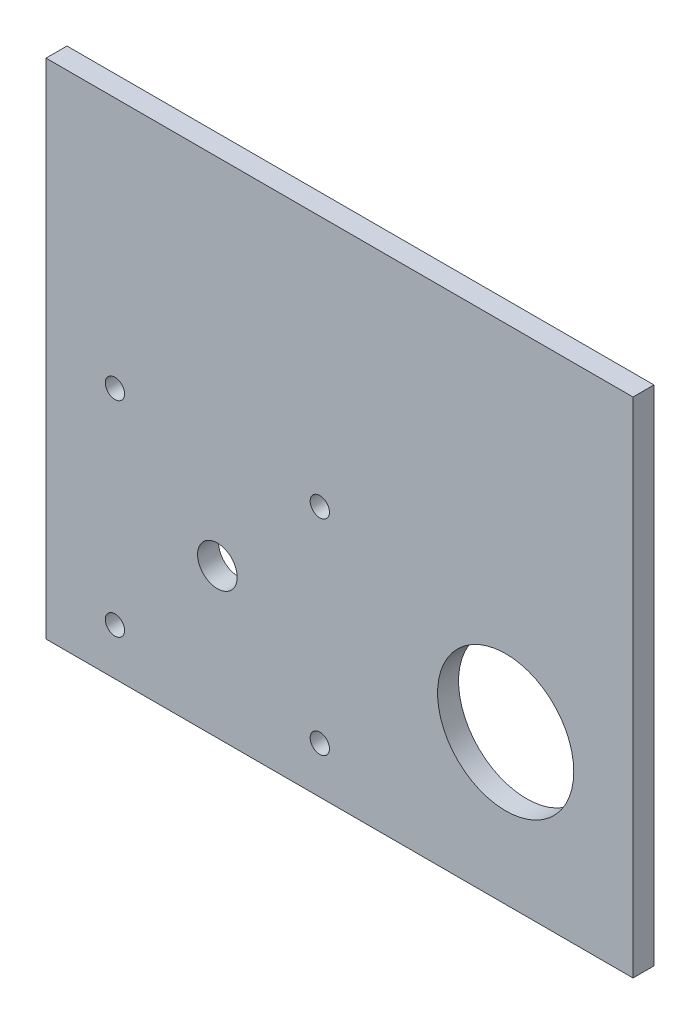
ISO-10303-21;
HEADER;
FILE_DESCRIPTION(('STEP AP214'),'2;1');
FILE_NAME('part.step','',(''),(''),'','','');
FILE_SCHEMA(('AUTOMOTIVE_DESIGN { 1 0 10303 214 1 1 1 1 }'));
ENDSEC;
DATA;
#1=APPLICATION_CONTEXT('core data for automotive mechanical design processes');
#2=APPLICATION_PROTOCOL_DEFINITION('international standard','automotive_design',2000,#1);
#3=PRODUCT_CONTEXT('',#1,'mechanical');
#4=PRODUCT('Part','Part','',(#3));
#5=PRODUCT_RELATED_PRODUCT_CATEGORY('part','',(#4));
#6=PRODUCT_DEFINITION_FORMATION('','',#4);
#7=PRODUCT_DEFINITION_CONTEXT('part definition',#1,'design');
#8=PRODUCT_DEFINITION('design','',#6,#7);
#9=PRODUCT_DEFINITION_SHAPE('','',#8);
#10=(LENGTH_UNIT() NAMED_UNIT(*) SI_UNIT(.MILLI.,.METRE.));
#11=(NAMED_UNIT(*) PLANE_ANGLE_UNIT() SI_UNIT($,.RADIAN.));
#12=(NAMED_UNIT(*) SI_UNIT($,.STERADIAN.) SOLID_ANGLE_UNIT());
#13=UNCERTAINTY_MEASURE_WITH_UNIT(LENGTH_MEASURE(1.E-05),#10,'distance_accuracy_value','');
#14=(GEOMETRIC_REPRESENTATION_CONTEXT(3) GLOBAL_UNCERTAINTY_ASSIGNED_CONTEXT((#13)) GLOBAL_UNIT_ASSIGNED_CONTEXT((#10,
#11,#12)) REPRESENTATION_CONTEXT('',''));
#15=CARTESIAN_POINT('',(0.,0.,0.));
#16=DIRECTION('',(0.,0.,1.));
#17=DIRECTION('',(1.,0.,0.));
#18=AXIS2_PLACEMENT_3D('',#15,#16,#17);
#19=CARTESIAN_POINT('',(0.,0.,3.175));
#20=DIRECTION('',(0.,0.,-1.));
#21=DIRECTION('',(-1.,0.,0.));
#22=AXIS2_PLACEMENT_3D('',#19,#20,#21);
#23=PLANE('',#22);
#24=CARTESIAN_POINT('',(25.95025,22.585,3.175));
#25=DIRECTION('',(0.,0.,1.));
#26=DIRECTION('',(1.,0.,0.));
#27=AXIS2_PLACEMENT_3D('',#24,#25,#26);
#28=CIRCLE('',#27,3.);
#29=CARTESIAN_POINT('',(28.95025,22.585,3.175));
#30=VERTEX_POINT('',#29);
#31=EDGE_CURVE('E132',#30,#30,#28,.T.);
#32=ORIENTED_EDGE('',*,*,#31,.F.);
#33=EDGE_LOOP('',(#32));
#34=FACE_BOUND('',#33,.T.);
#35=CARTESIAN_POINT('',(41.46525,7.07,3.175));
#36=DIRECTION('',(0.,0.,1.));
#37=DIRECTION('',(1.,0.,0.));
#38=AXIS2_PLACEMENT_3D('',#35,#36,#37);
#39=CIRCLE('',#38,1.4605);
#40=CARTESIAN_POINT('',(42.92575,7.07,3.175));
#41=VERTEX_POINT('',#40);
#42=EDGE_CURVE('E120',#41,#41,#39,.T.);
#43=ORIENTED_EDGE('',*,*,#42,.F.);
#44=EDGE_LOOP('',(#43));
#45=FACE_BOUND('',#44,.T.);
#46=CARTESIAN_POINT('',(10.43525,38.1,3.175));
#47=DIRECTION('',(0.,0.,1.));
#48=DIRECTION('',(1.,0.,0.));
#49=AXIS2_PLACEMENT_3D('',#46,#47,#48);
#50=CIRCLE('',#49,1.4605);
#51=CARTESIAN_POINT('',(11.89575,38.1,3.175));
#52=VERTEX_POINT('',#51);
#53=EDGE_CURVE('E99',#52,#52,#50,.T.);
#54=ORIENTED_EDGE('',*,*,#53,.F.);
#55=EDGE_LOOP('',(#54));
#56=FACE_BOUND('',#55,.T.);
#57=DIRECTION('',(0.,-1.,0.));
#58=VECTOR('',#57,1.);
#59=CARTESIAN_POINT('',(0.,0.,3.175));
#60=LINE('',#59,#58);
#61=CARTESIAN_POINT('',(0.,76.2,3.175));
#62=VERTEX_POINT('',#61);
#63=CARTESIAN_POINT('',(0.,0.,3.175));
#64=VERTEX_POINT('',#63);
#65=EDGE_CURVE('E84',#62,#64,#60,.T.);
#66=ORIENTED_EDGE('',*,*,#65,.T.);
#67=DIRECTION('',(1.,0.,0.));
#68=VECTOR('',#67,1.);
#69=CARTESIAN_POINT('',(0.,0.,3.175));
#70=LINE('',#69,#68);
#71=CARTESIAN_POINT('',(88.9,0.,3.175));
#72=VERTEX_POINT('',#71);
#73=EDGE_CURVE('E79',#64,#72,#70,.T.);
#74=ORIENTED_EDGE('',*,*,#73,.T.);
#75=DIRECTION('',(0.,1.,0.));
#76=VECTOR('',#75,1.);
#77=CARTESIAN_POINT('',(88.9,0.,3.175));
#78=LINE('',#77,#76);
#79=CARTESIAN_POINT('',(88.9,76.2,3.175));
#80=VERTEX_POINT('',#79);
#81=EDGE_CURVE('E82',#72,#80,#78,.T.);
#82=ORIENTED_EDGE('',*,*,#81,.T.);
#83=DIRECTION('',(-1.,0.,0.));
#84=VECTOR('',#83,1.);
#85=CARTESIAN_POINT('',(0.,76.2,3.175));
#86=LINE('',#85,#84);
#87=EDGE_CURVE('E49',#80,#62,#86,.T.);
#88=ORIENTED_EDGE('',*,*,#87,.T.);
#89=EDGE_LOOP('',(#66,#74,#82,#88));
#90=FACE_BOUND('',#89,.T.);
#91=CARTESIAN_POINT('',(41.46525,38.1,3.175));
#92=DIRECTION('',(0.,0.,1.));
#93=DIRECTION('',(1.,0.,0.));
#94=AXIS2_PLACEMENT_3D('',#91,#92,#93);
#95=CIRCLE('',#94,1.4605);
#96=CARTESIAN_POINT('',(42.92575,38.1,3.175));
#97=VERTEX_POINT('',#96);
#98=EDGE_CURVE('E114',#97,#97,#95,.T.);
#99=ORIENTED_EDGE('',*,*,#98,.F.);
#100=EDGE_LOOP('',(#99));
#101=FACE_BOUND('',#100,.T.);
#102=CARTESIAN_POINT('',(10.43525,7.07,3.175));
#103=DIRECTION('',(0.,0.,1.));
#104=DIRECTION('',(1.,0.,0.));
#105=AXIS2_PLACEMENT_3D('',#102,#103,#104);
#106=CIRCLE('',#105,1.4605);
#107=CARTESIAN_POINT('',(11.89575,7.07,3.175));
#108=VERTEX_POINT('',#107);
#109=EDGE_CURVE('E126',#108,#108,#106,.T.);
#110=ORIENTED_EDGE('',*,*,#109,.F.);
#111=EDGE_LOOP('',(#110));
#112=FACE_BOUND('',#111,.T.);
#113=CARTESIAN_POINT('',(69.61285,22.585,3.175));
#114=DIRECTION('',(0.,0.,1.));
#115=DIRECTION('',(1.,0.,0.));
#116=AXIS2_PLACEMENT_3D('',#113,#114,#115);
#117=CIRCLE('',#116,10.3124);
#118=CARTESIAN_POINT('',(79.92525,22.585,3.175));
#119=VERTEX_POINT('',#118);
#120=EDGE_CURVE('E138',#119,#119,#117,.T.);
#121=ORIENTED_EDGE('',*,*,#120,.F.);
#122=EDGE_LOOP('',(#121));
#123=FACE_BOUND('',#122,.T.);
#124=ADVANCED_FACE('F32',(#34,#45,#56,#90,#101,#112,#123),#23,.F.);
#125=CARTESIAN_POINT('',(0.,0.,0.));
#126=DIRECTION('',(0.,0.,-1.));
#127=DIRECTION('',(-1.,0.,0.));
#128=AXIS2_PLACEMENT_3D('',#125,#126,#127);
#129=PLANE('',#128);
#130=CARTESIAN_POINT('',(25.95025,22.585,0.));
#131=DIRECTION('',(0.,0.,1.));
#132=DIRECTION('',(1.,0.,0.));
#133=AXIS2_PLACEMENT_3D('',#130,#131,#132);
#134=CIRCLE('',#133,3.);
#135=CARTESIAN_POINT('',(28.95025,22.585,0.));
#136=VERTEX_POINT('',#135);
#137=EDGE_CURVE('E135',#136,#136,#134,.T.);
#138=ORIENTED_EDGE('',*,*,#137,.T.);
#139=EDGE_LOOP('',(#138));
#140=FACE_BOUND('',#139,.T.);
#141=CARTESIAN_POINT('',(41.46525,7.07,0.));
#142=DIRECTION('',(0.,0.,1.));
#143=DIRECTION('',(1.,0.,0.));
#144=AXIS2_PLACEMENT_3D('',#141,#142,#143);
#145=CIRCLE('',#144,1.4605);
#146=CARTESIAN_POINT('',(42.92575,7.07,0.));
#147=VERTEX_POINT('',#146);
#148=EDGE_CURVE('E123',#147,#147,#145,.T.);
#149=ORIENTED_EDGE('',*,*,#148,.T.);
#150=EDGE_LOOP('',(#149));
#151=FACE_BOUND('',#150,.T.);
#152=CARTESIAN_POINT('',(10.43525,38.1,0.));
#153=DIRECTION('',(0.,0.,1.));
#154=DIRECTION('',(1.,0.,0.));
#155=AXIS2_PLACEMENT_3D('',#152,#153,#154);
#156=CIRCLE('',#155,1.4605);
#157=CARTESIAN_POINT('',(11.89575,38.1,0.));
#158=VERTEX_POINT('',#157);
#159=EDGE_CURVE('E111',#158,#158,#156,.T.);
#160=ORIENTED_EDGE('',*,*,#159,.T.);
#161=EDGE_LOOP('',(#160));
#162=FACE_BOUND('',#161,.T.);
#163=DIRECTION('',(0.,-1.,0.));
#164=VECTOR('',#163,1.);
#165=CARTESIAN_POINT('',(0.,0.,0.));
#166=LINE('',#165,#164);
#167=CARTESIAN_POINT('',(0.,76.2,0.));
#168=VERTEX_POINT('',#167);
#169=CARTESIAN_POINT('',(0.,0.,0.));
#170=VERTEX_POINT('',#169);
#171=EDGE_CURVE('E96',#168,#170,#166,.T.);
#172=ORIENTED_EDGE('',*,*,#171,.F.);
#173=DIRECTION('',(-1.,0.,0.));
#174=VECTOR('',#173,1.);
#175=CARTESIAN_POINT('',(0.,76.2,0.));
#176=LINE('',#175,#174);
#177=CARTESIAN_POINT('',(88.9,76.2,0.));
#178=VERTEX_POINT('',#177);
#179=EDGE_CURVE('E72',#178,#168,#176,.T.);
#180=ORIENTED_EDGE('',*,*,#179,.F.);
#181=DIRECTION('',(0.,1.,0.));
#182=VECTOR('',#181,1.);
#183=CARTESIAN_POINT('',(88.9,0.,0.));
#184=LINE('',#183,#182);
#185=CARTESIAN_POINT('',(88.9,0.,0.));
#186=VERTEX_POINT('',#185);
#187=EDGE_CURVE('E66',#186,#178,#184,.T.);
#188=ORIENTED_EDGE('',*,*,#187,.F.);
#189=DIRECTION('',(1.,0.,0.));
#190=VECTOR('',#189,1.);
#191=CARTESIAN_POINT('',(0.,0.,0.));
#192=LINE('',#191,#190);
#193=EDGE_CURVE('E88',#170,#186,#192,.T.);
#194=ORIENTED_EDGE('',*,*,#193,.F.);
#195=EDGE_LOOP('',(#172,#180,#188,#194));
#196=FACE_BOUND('',#195,.T.);
#197=CARTESIAN_POINT('',(41.46525,38.1,0.));
#198=DIRECTION('',(0.,0.,1.));
#199=DIRECTION('',(1.,0.,0.));
#200=AXIS2_PLACEMENT_3D('',#197,#198,#199);
#201=CIRCLE('',#200,1.4605);
#202=CARTESIAN_POINT('',(42.92575,38.1,0.));
#203=VERTEX_POINT('',#202);
#204=EDGE_CURVE('E117',#203,#203,#201,.T.);
#205=ORIENTED_EDGE('',*,*,#204,.T.);
#206=EDGE_LOOP('',(#205));
#207=FACE_BOUND('',#206,.T.);
#208=CARTESIAN_POINT('',(10.43525,7.07,0.));
#209=DIRECTION('',(0.,0.,1.));
#210=DIRECTION('',(1.,0.,0.));
#211=AXIS2_PLACEMENT_3D('',#208,#209,#210);
#212=CIRCLE('',#211,1.4605);
#213=CARTESIAN_POINT('',(11.89575,7.07,0.));
#214=VERTEX_POINT('',#213);
#215=EDGE_CURVE('E129',#214,#214,#212,.T.);
#216=ORIENTED_EDGE('',*,*,#215,.T.);
#217=EDGE_LOOP('',(#216));
#218=FACE_BOUND('',#217,.T.);
#219=CARTESIAN_POINT('',(69.61285,22.585,0.));
#220=DIRECTION('',(0.,0.,1.));
#221=DIRECTION('',(1.,0.,0.));
#222=AXIS2_PLACEMENT_3D('',#219,#220,#221);
#223=CIRCLE('',#222,10.3124);
#224=CARTESIAN_POINT('',(79.92525,22.585,0.));
#225=VERTEX_POINT('',#224);
#226=EDGE_CURVE('E141',#225,#225,#223,.T.);
#227=ORIENTED_EDGE('',*,*,#226,.T.);
#228=EDGE_LOOP('',(#227));
#229=FACE_BOUND('',#228,.T.);
#230=ADVANCED_FACE('F107',(#140,#151,#162,#196,#207,#218,#229),#129,.T.);
#231=CARTESIAN_POINT('',(0.,0.,3.175));
#232=DIRECTION('',(1.,0.,0.));
#233=DIRECTION('',(0.,0.,-1.));
#234=AXIS2_PLACEMENT_3D('',#231,#232,#233);
#235=PLANE('',#234);
#236=ORIENTED_EDGE('',*,*,#171,.T.);
#237=DIRECTION('',(0.,0.,-1.));
#238=VECTOR('',#237,1.);
#239=CARTESIAN_POINT('',(0.,0.,3.175));
#240=LINE('',#239,#238);
#241=EDGE_CURVE('E11',#64,#170,#240,.T.);
#242=ORIENTED_EDGE('',*,*,#241,.F.);
#243=ORIENTED_EDGE('',*,*,#65,.F.);
#244=DIRECTION('',(0.,0.,-1.));
#245=VECTOR('',#244,1.);
#246=CARTESIAN_POINT('',(0.,76.2,3.175));
#247=LINE('',#246,#245);
#248=EDGE_CURVE('E92',#62,#168,#247,.T.);
#249=ORIENTED_EDGE('',*,*,#248,.T.);
#250=EDGE_LOOP('',(#236,#242,#243,#249));
#251=FACE_BOUND('',#250,.T.);
#252=ADVANCED_FACE('F34',(#251),#235,.F.);
#253=CARTESIAN_POINT('',(0.,0.,3.175));
#254=DIRECTION('',(0.,1.,0.));
#255=DIRECTION('',(0.,0.,1.));
#256=AXIS2_PLACEMENT_3D('',#253,#254,#255);
#257=PLANE('',#256);
#258=ORIENTED_EDGE('',*,*,#193,.T.);
#259=DIRECTION('',(0.,0.,-1.));
#260=VECTOR('',#259,1.);
#261=CARTESIAN_POINT('',(88.9,0.,3.175));
#262=LINE('',#261,#260);
#263=EDGE_CURVE('E41',#72,#186,#262,.T.);
#264=ORIENTED_EDGE('',*,*,#263,.F.);
#265=ORIENTED_EDGE('',*,*,#73,.F.);
#266=ORIENTED_EDGE('',*,*,#241,.T.);
#267=EDGE_LOOP('',(#258,#264,#265,#266));
#268=FACE_BOUND('',#267,.T.);
#269=ADVANCED_FACE('F87',(#268),#257,.F.);
#270=CARTESIAN_POINT('',(88.9,0.,3.175));
#271=DIRECTION('',(-1.,0.,0.));
#272=DIRECTION('',(0.,0.,1.));
#273=AXIS2_PLACEMENT_3D('',#270,#271,#272);
#274=PLANE('',#273);
#275=ORIENTED_EDGE('',*,*,#187,.T.);
#276=DIRECTION('',(0.,0.,-1.));
#277=VECTOR('',#276,1.);
#278=CARTESIAN_POINT('',(88.9,76.2,3.175));
#279=LINE('',#278,#277);
#280=EDGE_CURVE('E89',#80,#178,#279,.T.);
#281=ORIENTED_EDGE('',*,*,#280,.F.);
#282=ORIENTED_EDGE('',*,*,#81,.F.);
#283=ORIENTED_EDGE('',*,*,#263,.T.);
#284=EDGE_LOOP('',(#275,#281,#282,#283));
#285=FACE_BOUND('',#284,.T.);
#286=ADVANCED_FACE('F90',(#285),#274,.F.);
#287=CARTESIAN_POINT('',(0.,76.2,3.175));
#288=DIRECTION('',(0.,-1.,0.));
#289=DIRECTION('',(0.,0.,-1.));
#290=AXIS2_PLACEMENT_3D('',#287,#288,#289);
#291=PLANE('',#290);
#292=ORIENTED_EDGE('',*,*,#179,.T.);
#293=ORIENTED_EDGE('',*,*,#248,.F.);
#294=ORIENTED_EDGE('',*,*,#87,.F.);
#295=ORIENTED_EDGE('',*,*,#280,.T.);
#296=EDGE_LOOP('',(#292,#293,#294,#295));
#297=FACE_BOUND('',#296,.T.);
#298=ADVANCED_FACE('F104',(#297),#291,.F.);
#299=CARTESIAN_POINT('',(10.43525,38.1,3.175));
#300=DIRECTION('',(0.,0.,-1.));
#301=DIRECTION('',(-1.,0.,0.));
#302=AXIS2_PLACEMENT_3D('',#299,#300,#301);
#303=CYLINDRICAL_SURFACE('',#302,1.4605);
#304=ORIENTED_EDGE('',*,*,#53,.T.);
#305=EDGE_LOOP('',(#304));
#306=FACE_BOUND('',#305,.T.);
#307=ORIENTED_EDGE('',*,*,#159,.F.);
#308=EDGE_LOOP('',(#307));
#309=FACE_BOUND('',#308,.T.);
#310=ADVANCED_FACE('F161',(#306,#309),#303,.F.);
#311=CARTESIAN_POINT('',(41.46525,38.1,3.175));
#312=DIRECTION('',(0.,0.,-1.));
#313=DIRECTION('',(-1.,0.,0.));
#314=AXIS2_PLACEMENT_3D('',#311,#312,#313);
#315=CYLINDRICAL_SURFACE('',#314,1.4605);
#316=ORIENTED_EDGE('',*,*,#98,.T.);
#317=EDGE_LOOP('',(#316));
#318=FACE_BOUND('',#317,.T.);
#319=ORIENTED_EDGE('',*,*,#204,.F.);
#320=EDGE_LOOP('',(#319));
#321=FACE_BOUND('',#320,.T.);
#322=ADVANCED_FACE('F207',(#318,#321),#315,.F.);
#323=CARTESIAN_POINT('',(41.46525,7.07,3.175));
#324=DIRECTION('',(0.,0.,-1.));
#325=DIRECTION('',(-1.,0.,0.));
#326=AXIS2_PLACEMENT_3D('',#323,#324,#325);
#327=CYLINDRICAL_SURFACE('',#326,1.4605);
#328=ORIENTED_EDGE('',*,*,#42,.T.);
#329=EDGE_LOOP('',(#328));
#330=FACE_BOUND('',#329,.T.);
#331=ORIENTED_EDGE('',*,*,#148,.F.);
#332=EDGE_LOOP('',(#331));
#333=FACE_BOUND('',#332,.T.);
#334=ADVANCED_FACE('F215',(#330,#333),#327,.F.);
#335=CARTESIAN_POINT('',(10.43525,7.07,3.175));
#336=DIRECTION('',(0.,0.,-1.));
#337=DIRECTION('',(-1.,0.,0.));
#338=AXIS2_PLACEMENT_3D('',#335,#336,#337);
#339=CYLINDRICAL_SURFACE('',#338,1.4605);
#340=ORIENTED_EDGE('',*,*,#109,.T.);
#341=EDGE_LOOP('',(#340));
#342=FACE_BOUND('',#341,.T.);
#343=ORIENTED_EDGE('',*,*,#215,.F.);
#344=EDGE_LOOP('',(#343));
#345=FACE_BOUND('',#344,.T.);
#346=ADVANCED_FACE('F223',(#342,#345),#339,.F.);
#347=CARTESIAN_POINT('',(25.95025,22.585,3.175));
#348=DIRECTION('',(0.,0.,-1.));
#349=DIRECTION('',(-1.,0.,0.));
#350=AXIS2_PLACEMENT_3D('',#347,#348,#349);
#351=CYLINDRICAL_SURFACE('',#350,3.);
#352=ORIENTED_EDGE('',*,*,#31,.T.);
#353=EDGE_LOOP('',(#352));
#354=FACE_BOUND('',#353,.T.);
#355=ORIENTED_EDGE('',*,*,#137,.F.);
#356=EDGE_LOOP('',(#355));
#357=FACE_BOUND('',#356,.T.);
#358=ADVANCED_FACE('F232',(#354,#357),#351,.F.);
#359=CARTESIAN_POINT('',(69.61285,22.585,3.175));
#360=DIRECTION('',(0.,0.,-1.));
#361=DIRECTION('',(-1.,0.,0.));
#362=AXIS2_PLACEMENT_3D('',#359,#360,#361);
#363=CYLINDRICAL_SURFACE('',#362,10.3124);
#364=ORIENTED_EDGE('',*,*,#120,.T.);
#365=EDGE_LOOP('',(#364));
#366=FACE_BOUND('',#365,.T.);
#367=ORIENTED_EDGE('',*,*,#226,.F.);
#368=EDGE_LOOP('',(#367));
#369=FACE_BOUND('',#368,.T.);
#370=ADVANCED_FACE('F147',(#366,#369),#363,.F.);
#371=CLOSED_SHELL('',(#124,#230,#252,#269,#286,#298,#310,#322,#334,#346,#358,#370));
#372=MANIFOLD_SOLID_BREP('B2',#371);
#373=ADVANCED_BREP_SHAPE_REPRESENTATION('',(#18,#372),#14);
#374=SHAPE_DEFINITION_REPRESENTATION(#9,#373);
ENDSEC;
END-ISO-10303-21;
